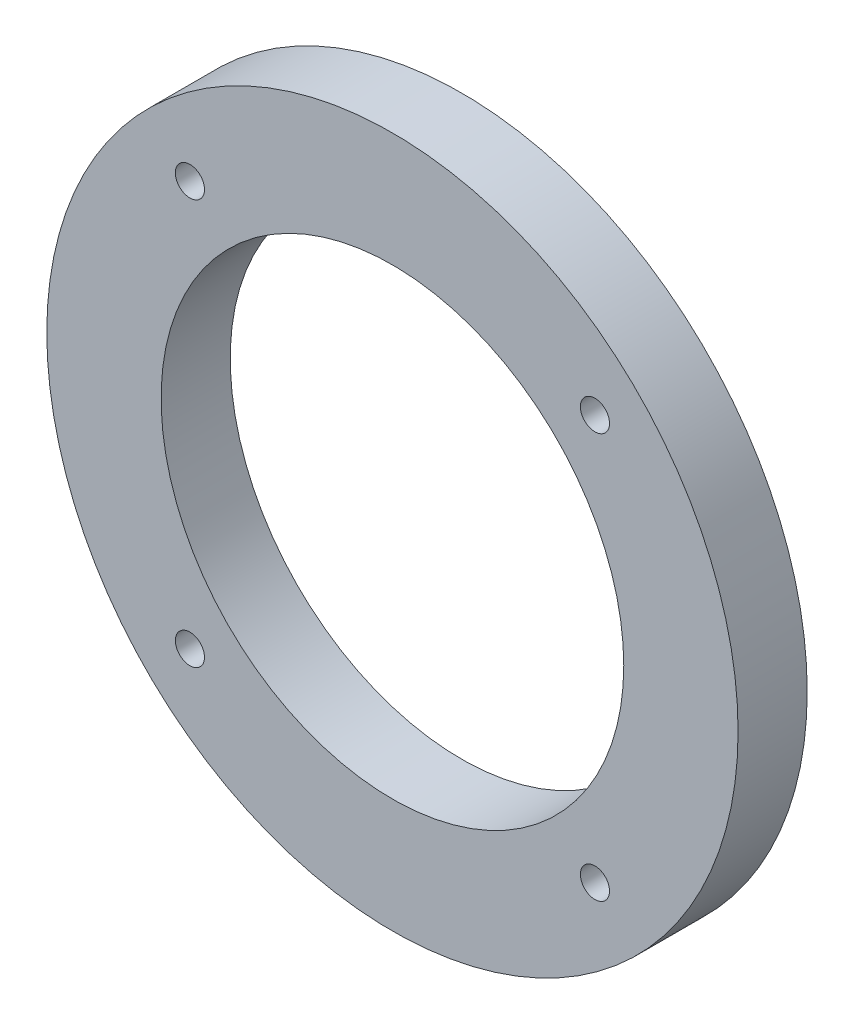
ISO-10303-21;
HEADER;
FILE_DESCRIPTION(('STEP AP214'),'2;1');
FILE_NAME('part.step','',(''),(''),'','','');
FILE_SCHEMA(('AUTOMOTIVE_DESIGN { 1 0 10303 214 1 1 1 1 }'));
ENDSEC;
DATA;
#1=APPLICATION_CONTEXT('core data for automotive mechanical design processes');
#2=APPLICATION_PROTOCOL_DEFINITION('international standard','automotive_design',2000,#1);
#3=PRODUCT_CONTEXT('',#1,'mechanical');
#4=PRODUCT('Part','Part','',(#3));
#5=PRODUCT_RELATED_PRODUCT_CATEGORY('part','',(#4));
#6=PRODUCT_DEFINITION_FORMATION('','',#4);
#7=PRODUCT_DEFINITION_CONTEXT('part definition',#1,'design');
#8=PRODUCT_DEFINITION('design','',#6,#7);
#9=PRODUCT_DEFINITION_SHAPE('','',#8);
#10=(LENGTH_UNIT() NAMED_UNIT(*) SI_UNIT(.MILLI.,.METRE.));
#11=(NAMED_UNIT(*) PLANE_ANGLE_UNIT() SI_UNIT($,.RADIAN.));
#12=(NAMED_UNIT(*) SI_UNIT($,.STERADIAN.) SOLID_ANGLE_UNIT());
#13=UNCERTAINTY_MEASURE_WITH_UNIT(LENGTH_MEASURE(1.E-05),#10,'distance_accuracy_value','');
#14=(GEOMETRIC_REPRESENTATION_CONTEXT(3) GLOBAL_UNCERTAINTY_ASSIGNED_CONTEXT((#13)) GLOBAL_UNIT_ASSIGNED_CONTEXT((#10,
#11,#12)) REPRESENTATION_CONTEXT('',''));
#15=CARTESIAN_POINT('',(0.,0.,0.));
#16=DIRECTION('',(0.,0.,1.));
#17=DIRECTION('',(1.,0.,0.));
#18=AXIS2_PLACEMENT_3D('',#15,#16,#17);
#19=CARTESIAN_POINT('',(0.,0.,7.));
#20=DIRECTION('',(0.,0.,1.));
#21=DIRECTION('',(1.,0.,0.));
#22=AXIS2_PLACEMENT_3D('',#19,#20,#21);
#23=PLANE('',#22);
#24=CARTESIAN_POINT('',(20.5060966544111,-20.5060966544086,7.));
#25=DIRECTION('',(0.,0.,1.));
#26=DIRECTION('',(1.,0.,0.));
#27=AXIS2_PLACEMENT_3D('',#24,#25,#26);
#28=CIRCLE('',#27,1.47500000000163);
#29=CARTESIAN_POINT('',(21.9810966544128,-20.5060966544086,7.));
#30=VERTEX_POINT('',#29);
#31=EDGE_CURVE('E58',#30,#30,#28,.T.);
#32=ORIENTED_EDGE('',*,*,#31,.F.);
#33=EDGE_LOOP('',(#32));
#34=FACE_BOUND('',#33,.T.);
#35=CARTESIAN_POINT('',(-20.50609665441,20.5060966544098,7.));
#36=DIRECTION('',(0.,0.,1.));
#37=DIRECTION('',(1.,0.,0.));
#38=AXIS2_PLACEMENT_3D('',#35,#36,#37);
#39=CIRCLE('',#38,1.475);
#40=CARTESIAN_POINT('',(-19.03109665441,20.5060966544098,7.));
#41=VERTEX_POINT('',#40);
#42=EDGE_CURVE('E46',#41,#41,#39,.T.);
#43=ORIENTED_EDGE('',*,*,#42,.F.);
#44=EDGE_LOOP('',(#43));
#45=FACE_BOUND('',#44,.T.);
#46=CARTESIAN_POINT('',(0.,0.,7.));
#47=DIRECTION('',(0.,0.,1.));
#48=DIRECTION('',(1.,0.,0.));
#49=AXIS2_PLACEMENT_3D('',#46,#47,#48);
#50=CIRCLE('',#49,35.);
#51=CARTESIAN_POINT('',(35.,0.,7.));
#52=VERTEX_POINT('',#51);
#53=EDGE_CURVE('E10',#52,#52,#50,.T.);
#54=ORIENTED_EDGE('',*,*,#53,.T.);
#55=EDGE_LOOP('',(#54));
#56=FACE_BOUND('',#55,.T.);
#57=CARTESIAN_POINT('',(0.,0.,7.));
#58=DIRECTION('',(0.,0.,1.));
#59=DIRECTION('',(1.,0.,0.));
#60=AXIS2_PLACEMENT_3D('',#57,#58,#59);
#61=CIRCLE('',#60,23.425);
#62=CARTESIAN_POINT('',(23.425,0.,7.));
#63=VERTEX_POINT('',#62);
#64=EDGE_CURVE('E41',#63,#63,#61,.T.);
#65=ORIENTED_EDGE('',*,*,#64,.F.);
#66=EDGE_LOOP('',(#65));
#67=FACE_BOUND('',#66,.T.);
#68=CARTESIAN_POINT('',(20.5060966544098,20.5060966544111,7.));
#69=DIRECTION('',(0.,0.,1.));
#70=DIRECTION('',(1.,0.,0.));
#71=AXIS2_PLACEMENT_3D('',#68,#69,#70);
#72=CIRCLE('',#71,1.47500000000119);
#73=CARTESIAN_POINT('',(21.981096654411,20.5060966544111,7.));
#74=VERTEX_POINT('',#73);
#75=EDGE_CURVE('E52',#74,#74,#72,.T.);
#76=ORIENTED_EDGE('',*,*,#75,.F.);
#77=EDGE_LOOP('',(#76));
#78=FACE_BOUND('',#77,.T.);
#79=CARTESIAN_POINT('',(-20.5060966544086,-20.50609665441,7.));
#80=DIRECTION('',(0.,0.,1.));
#81=DIRECTION('',(1.,0.,0.));
#82=AXIS2_PLACEMENT_3D('',#79,#80,#81);
#83=CIRCLE('',#82,1.47500000000061);
#84=CARTESIAN_POINT('',(-19.031096654408,-20.50609665441,7.));
#85=VERTEX_POINT('',#84);
#86=EDGE_CURVE('E64',#85,#85,#83,.T.);
#87=ORIENTED_EDGE('',*,*,#86,.F.);
#88=EDGE_LOOP('',(#87));
#89=FACE_BOUND('',#88,.T.);
#90=ADVANCED_FACE('F30',(#34,#45,#56,#67,#78,#89),#23,.T.);
#91=CARTESIAN_POINT('',(0.,0.,0.));
#92=DIRECTION('',(0.,0.,1.));
#93=DIRECTION('',(1.,0.,0.));
#94=AXIS2_PLACEMENT_3D('',#91,#92,#93);
#95=PLANE('',#94);
#96=CARTESIAN_POINT('',(0.,0.,0.));
#97=DIRECTION('',(0.,0.,1.));
#98=DIRECTION('',(1.,0.,0.));
#99=AXIS2_PLACEMENT_3D('',#96,#97,#98);
#100=CIRCLE('',#99,35.);
#101=CARTESIAN_POINT('',(35.,0.,0.));
#102=VERTEX_POINT('',#101);
#103=EDGE_CURVE('E34',#102,#102,#100,.T.);
#104=ORIENTED_EDGE('',*,*,#103,.F.);
#105=EDGE_LOOP('',(#104));
#106=FACE_BOUND('',#105,.T.);
#107=CARTESIAN_POINT('',(0.,0.,0.));
#108=DIRECTION('',(0.,0.,1.));
#109=DIRECTION('',(1.,0.,0.));
#110=AXIS2_PLACEMENT_3D('',#107,#108,#109);
#111=CIRCLE('',#110,23.425);
#112=CARTESIAN_POINT('',(23.425,0.,0.));
#113=VERTEX_POINT('',#112);
#114=EDGE_CURVE('E43',#113,#113,#111,.T.);
#115=ORIENTED_EDGE('',*,*,#114,.T.);
#116=EDGE_LOOP('',(#115));
#117=FACE_BOUND('',#116,.T.);
#118=CARTESIAN_POINT('',(-20.50609665441,20.5060966544098,0.));
#119=DIRECTION('',(0.,0.,1.));
#120=DIRECTION('',(1.,0.,0.));
#121=AXIS2_PLACEMENT_3D('',#118,#119,#120);
#122=CIRCLE('',#121,1.475);
#123=CARTESIAN_POINT('',(-19.03109665441,20.5060966544098,0.));
#124=VERTEX_POINT('',#123);
#125=EDGE_CURVE('E49',#124,#124,#122,.T.);
#126=ORIENTED_EDGE('',*,*,#125,.T.);
#127=EDGE_LOOP('',(#126));
#128=FACE_BOUND('',#127,.T.);
#129=CARTESIAN_POINT('',(20.5060966544098,20.5060966544111,0.));
#130=DIRECTION('',(0.,0.,1.));
#131=DIRECTION('',(1.,0.,0.));
#132=AXIS2_PLACEMENT_3D('',#129,#130,#131);
#133=CIRCLE('',#132,1.47500000000119);
#134=CARTESIAN_POINT('',(21.981096654411,20.5060966544111,0.));
#135=VERTEX_POINT('',#134);
#136=EDGE_CURVE('E55',#135,#135,#133,.T.);
#137=ORIENTED_EDGE('',*,*,#136,.T.);
#138=EDGE_LOOP('',(#137));
#139=FACE_BOUND('',#138,.T.);
#140=CARTESIAN_POINT('',(20.5060966544111,-20.5060966544086,0.));
#141=DIRECTION('',(0.,0.,1.));
#142=DIRECTION('',(1.,0.,0.));
#143=AXIS2_PLACEMENT_3D('',#140,#141,#142);
#144=CIRCLE('',#143,1.47500000000163);
#145=CARTESIAN_POINT('',(21.9810966544128,-20.5060966544086,0.));
#146=VERTEX_POINT('',#145);
#147=EDGE_CURVE('E61',#146,#146,#144,.T.);
#148=ORIENTED_EDGE('',*,*,#147,.T.);
#149=EDGE_LOOP('',(#148));
#150=FACE_BOUND('',#149,.T.);
#151=CARTESIAN_POINT('',(-20.5060966544086,-20.50609665441,0.));
#152=DIRECTION('',(0.,0.,1.));
#153=DIRECTION('',(1.,0.,0.));
#154=AXIS2_PLACEMENT_3D('',#151,#152,#153);
#155=CIRCLE('',#154,1.47500000000061);
#156=CARTESIAN_POINT('',(-19.031096654408,-20.50609665441,0.));
#157=VERTEX_POINT('',#156);
#158=EDGE_CURVE('E67',#157,#157,#155,.T.);
#159=ORIENTED_EDGE('',*,*,#158,.T.);
#160=EDGE_LOOP('',(#159));
#161=FACE_BOUND('',#160,.T.);
#162=ADVANCED_FACE('F77',(#106,#117,#128,#139,#150,#161),#95,.F.);
#163=CARTESIAN_POINT('',(0.,0.,7.));
#164=DIRECTION('',(0.,0.,-1.));
#165=DIRECTION('',(-1.,0.,0.));
#166=AXIS2_PLACEMENT_3D('',#163,#164,#165);
#167=CYLINDRICAL_SURFACE('',#166,35.);
#168=ORIENTED_EDGE('',*,*,#53,.F.);
#169=EDGE_LOOP('',(#168));
#170=FACE_BOUND('',#169,.T.);
#171=ORIENTED_EDGE('',*,*,#103,.T.);
#172=EDGE_LOOP('',(#171));
#173=FACE_BOUND('',#172,.T.);
#174=ADVANCED_FACE('F32',(#170,#173),#167,.T.);
#175=CARTESIAN_POINT('',(0.,0.,7.));
#176=DIRECTION('',(0.,0.,-1.));
#177=DIRECTION('',(-1.,0.,0.));
#178=AXIS2_PLACEMENT_3D('',#175,#176,#177);
#179=CYLINDRICAL_SURFACE('',#178,23.425);
#180=ORIENTED_EDGE('',*,*,#64,.T.);
#181=EDGE_LOOP('',(#180));
#182=FACE_BOUND('',#181,.T.);
#183=ORIENTED_EDGE('',*,*,#114,.F.);
#184=EDGE_LOOP('',(#183));
#185=FACE_BOUND('',#184,.T.);
#186=ADVANCED_FACE('F87',(#182,#185),#179,.F.);
#187=CARTESIAN_POINT('',(-20.50609665441,20.5060966544098,7.));
#188=DIRECTION('',(0.,0.,-1.));
#189=DIRECTION('',(-1.,0.,0.));
#190=AXIS2_PLACEMENT_3D('',#187,#188,#189);
#191=CYLINDRICAL_SURFACE('',#190,1.475);
#192=ORIENTED_EDGE('',*,*,#42,.T.);
#193=EDGE_LOOP('',(#192));
#194=FACE_BOUND('',#193,.T.);
#195=ORIENTED_EDGE('',*,*,#125,.F.);
#196=EDGE_LOOP('',(#195));
#197=FACE_BOUND('',#196,.T.);
#198=ADVANCED_FACE('F90',(#194,#197),#191,.F.);
#199=CARTESIAN_POINT('',(20.5060966544098,20.5060966544111,7.));
#200=DIRECTION('',(0.,0.,-1.));
#201=DIRECTION('',(-1.,0.,0.));
#202=AXIS2_PLACEMENT_3D('',#199,#200,#201);
#203=CYLINDRICAL_SURFACE('',#202,1.47500000000119);
#204=ORIENTED_EDGE('',*,*,#75,.T.);
#205=EDGE_LOOP('',(#204));
#206=FACE_BOUND('',#205,.T.);
#207=ORIENTED_EDGE('',*,*,#136,.F.);
#208=EDGE_LOOP('',(#207));
#209=FACE_BOUND('',#208,.T.);
#210=ADVANCED_FACE('F94',(#206,#209),#203,.F.);
#211=CARTESIAN_POINT('',(20.5060966544111,-20.5060966544086,7.));
#212=DIRECTION('',(0.,0.,-1.));
#213=DIRECTION('',(-1.,0.,0.));
#214=AXIS2_PLACEMENT_3D('',#211,#212,#213);
#215=CYLINDRICAL_SURFACE('',#214,1.47500000000163);
#216=ORIENTED_EDGE('',*,*,#31,.T.);
#217=EDGE_LOOP('',(#216));
#218=FACE_BOUND('',#217,.T.);
#219=ORIENTED_EDGE('',*,*,#147,.F.);
#220=EDGE_LOOP('',(#219));
#221=FACE_BOUND('',#220,.T.);
#222=ADVANCED_FACE('F98',(#218,#221),#215,.F.);
#223=CARTESIAN_POINT('',(-20.5060966544086,-20.50609665441,7.));
#224=DIRECTION('',(0.,0.,-1.));
#225=DIRECTION('',(-1.,0.,0.));
#226=AXIS2_PLACEMENT_3D('',#223,#224,#225);
#227=CYLINDRICAL_SURFACE('',#226,1.47500000000061);
#228=ORIENTED_EDGE('',*,*,#86,.T.);
#229=EDGE_LOOP('',(#228));
#230=FACE_BOUND('',#229,.T.);
#231=ORIENTED_EDGE('',*,*,#158,.F.);
#232=EDGE_LOOP('',(#231));
#233=FACE_BOUND('',#232,.T.);
#234=ADVANCED_FACE('F73',(#230,#233),#227,.F.);
#235=CLOSED_SHELL('',(#90,#162,#174,#186,#198,#210,#222,#234));
#236=MANIFOLD_SOLID_BREP('B2',#235);
#237=ADVANCED_BREP_SHAPE_REPRESENTATION('',(#18,#236),#14);
#238=SHAPE_DEFINITION_REPRESENTATION(#9,#237);
ENDSEC;
END-ISO-10303-21;
